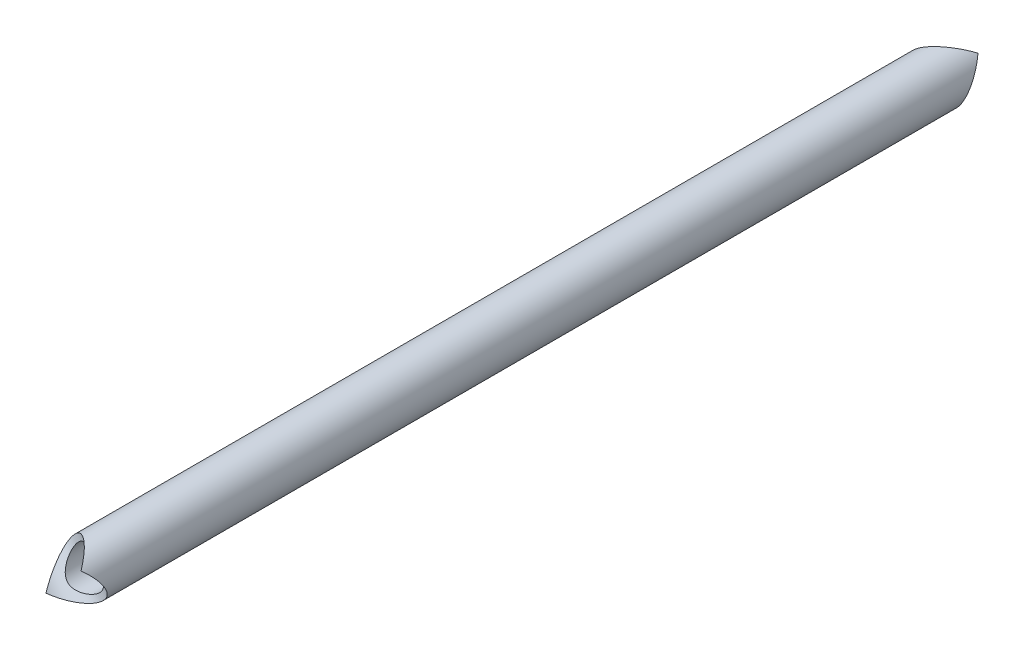
ISO-10303-21;
HEADER;
FILE_DESCRIPTION(('STEP AP214'),'2;1');
FILE_NAME('part.step','',(''),(''),'','','');
FILE_SCHEMA(('AUTOMOTIVE_DESIGN { 1 0 10303 214 1 1 1 1 }'));
ENDSEC;
DATA;
#1=APPLICATION_CONTEXT('core data for automotive mechanical design processes');
#2=APPLICATION_PROTOCOL_DEFINITION('international standard','automotive_design',2000,#1);
#3=PRODUCT_CONTEXT('',#1,'mechanical');
#4=PRODUCT('Part','Part','',(#3));
#5=PRODUCT_RELATED_PRODUCT_CATEGORY('part','',(#4));
#6=PRODUCT_DEFINITION_FORMATION('','',#4);
#7=PRODUCT_DEFINITION_CONTEXT('part definition',#1,'design');
#8=PRODUCT_DEFINITION('design','',#6,#7);
#9=PRODUCT_DEFINITION_SHAPE('','',#8);
#10=(LENGTH_UNIT() NAMED_UNIT(*) SI_UNIT(.MILLI.,.METRE.));
#11=(NAMED_UNIT(*) PLANE_ANGLE_UNIT() SI_UNIT($,.RADIAN.));
#12=(NAMED_UNIT(*) SI_UNIT($,.STERADIAN.) SOLID_ANGLE_UNIT());
#13=UNCERTAINTY_MEASURE_WITH_UNIT(LENGTH_MEASURE(1.E-05),#10,'distance_accuracy_value','');
#14=(GEOMETRIC_REPRESENTATION_CONTEXT(3) GLOBAL_UNCERTAINTY_ASSIGNED_CONTEXT((#13)) GLOBAL_UNIT_ASSIGNED_CONTEXT((#10,
#11,#12)) REPRESENTATION_CONTEXT('',''));
#15=CARTESIAN_POINT('',(0.,0.,0.));
#16=DIRECTION('',(0.,0.,1.));
#17=DIRECTION('',(1.,0.,0.));
#18=AXIS2_PLACEMENT_3D('',#15,#16,#17);
#19=CARTESIAN_POINT('',(2364.73313789473,514.219766290026,-224.530173537895));
#20=DIRECTION('',(0.,0.,1.));
#21=DIRECTION('',(1.,0.,0.));
#22=AXIS2_PLACEMENT_3D('',#19,#20,#21);
#23=CYLINDRICAL_SURFACE('',#22,9.64999999999982);
#24=CARTESIAN_POINT('',(2374.38313789473,514.219766290025,214.670255781294));
#25=CARTESIAN_POINT('',(2374.38313808255,514.48201971603,214.760425362817));
#26=CARTESIAN_POINT('',(2374.37245226315,514.74390513474,214.851658796265));
#27=CARTESIAN_POINT('',(2374.32981875689,515.266132938578,215.03391829087));
#28=CARTESIAN_POINT('',(2374.29786246496,515.526474656171,215.124944253132));
#29=CARTESIAN_POINT('',(2374.21258641161,516.045065522865,215.304195289557));
#30=CARTESIAN_POINT('',(2374.15923500596,516.303310991743,215.392416005119));
#31=CARTESIAN_POINT('',(2374.03098030421,516.816402016813,215.562765211823));
#32=CARTESIAN_POINT('',(2373.95608393449,517.071248638173,215.644895650239));
#33=CARTESIAN_POINT('',(2373.80328011211,517.521035627229,215.782429872911));
#34=CARTESIAN_POINT('',(2373.72964225494,517.716846645342,215.839743057099));
#35=CARTESIAN_POINT('',(2373.56891839295,518.105071506958,215.946408625565));
#36=CARTESIAN_POINT('',(2373.48183595112,518.297486235511,215.995763111938));
#37=CARTESIAN_POINT('',(2373.29437103687,518.677635494648,216.084243225108));
#38=CARTESIAN_POINT('',(2373.19401817692,518.865379371022,216.123391065975));
#39=CARTESIAN_POINT('',(2372.98004275199,519.235411706149,216.189342593095));
#40=CARTESIAN_POINT('',(2372.86642297691,519.417701301788,216.216148868807));
#41=CARTESIAN_POINT('',(2372.64549588637,519.746965326182,216.252226608424));
#42=CARTESIAN_POINT('',(2372.54004524568,519.894955553623,216.263604761974));
#43=CARTESIAN_POINT('',(2372.32071746326,520.185013980812,216.275157779931));
#44=CARTESIAN_POINT('',(2372.20684131261,520.327082874021,216.275333959931));
#45=CARTESIAN_POINT('',(2371.97153923492,520.60420593151,216.263871779228));
#46=CARTESIAN_POINT('',(2371.85011727051,520.739263710368,216.252239571216));
#47=CARTESIAN_POINT('',(2371.60068369811,521.001511500123,216.217043685097));
#48=CARTESIAN_POINT('',(2371.47267188028,521.128701260198,216.193479626839));
#49=CARTESIAN_POINT('',(2371.21158563812,521.374079855179,216.134887878899));
#50=CARTESIAN_POINT('',(2371.07852882691,521.492296332405,216.099897315335));
#51=CARTESIAN_POINT('',(2370.80801113251,521.719745783443,216.019240372173));
#52=CARTESIAN_POINT('',(2370.67054842432,521.828974965948,215.973569517974));
#53=CARTESIAN_POINT('',(2370.25273850926,522.143012543982,215.822033555208));
#54=CARTESIAN_POINT('',(2369.96711599436,522.334034674315,215.701679616841));
#55=CARTESIAN_POINT('',(2369.45114760468,522.641918524382,215.462102167777));
#56=CARTESIAN_POINT('',(2369.22232100826,522.765869648958,215.348348707594));
#57=CARTESIAN_POINT('',(2368.7608468601,522.992801167675,215.108037213251));
#58=CARTESIAN_POINT('',(2368.52819721108,523.095769605731,214.981471939958));
#59=CARTESIAN_POINT('',(2368.05948327602,523.281867544555,214.719238147483));
#60=CARTESIAN_POINT('',(2367.82341280292,523.364954577009,214.583550920654));
#61=CARTESIAN_POINT('',(2367.34865900657,523.511874219911,214.30660201296));
#62=CARTESIAN_POINT('',(2367.10997610416,523.575709885626,214.165341220669));
#63=CARTESIAN_POINT('',(2366.61807465916,523.687409652716,213.87283339981));
#64=CARTESIAN_POINT('',(2366.36472603522,523.73431560252,213.721440208481));
#65=CARTESIAN_POINT('',(2365.85530579232,523.807751565453,213.418254098226));
#66=CARTESIAN_POINT('',(2365.59923395139,523.834279904482,213.266461147485));
#67=CARTESIAN_POINT('',(2365.08477989803,523.866797631237,212.96511398704));
#68=CARTESIAN_POINT('',(2364.82639997138,523.872805475295,212.815557886115));
#69=CARTESIAN_POINT('',(2364.30745144093,523.863864043597,212.520937501229));
#70=CARTESIAN_POINT('',(2364.0468830773,523.848917038386,212.375872732356));
#71=CARTESIAN_POINT('',(2363.54743321558,523.799632101498,212.105249445946));
#72=CARTESIAN_POINT('',(2363.30868830028,523.767140812126,211.979104634793));
#73=CARTESIAN_POINT('',(2362.83053432901,523.683460051141,211.734404257281));
#74=CARTESIAN_POINT('',(2362.59112525828,523.632270160567,211.615848861042));
#75=CARTESIAN_POINT('',(2362.11286449719,523.510487590107,211.388436715519));
#76=CARTESIAN_POINT('',(2361.87401250268,523.439911889878,211.279571588694));
#77=CARTESIAN_POINT('',(2361.39805278381,523.27861837228,211.073558271176));
#78=CARTESIAN_POINT('',(2361.16094467039,523.187905197536,210.976407387757));
#79=CARTESIAN_POINT('',(2360.73647309743,523.005638492636,210.813725584907));
#80=CARTESIAN_POINT('',(2360.548479185,522.917743563572,210.74573091353));
#81=CARTESIAN_POINT('',(2360.17593362559,522.728468872491,210.619876570796));
#82=CARTESIAN_POINT('',(2359.99138124375,522.627092027726,210.562014713132));
#83=CARTESIAN_POINT('',(2359.62710399681,522.410965225827,210.457538598417));
#84=CARTESIAN_POINT('',(2359.44737650749,522.296222727224,210.410918112438));
#85=CARTESIAN_POINT('',(2359.09409119265,522.053638831572,210.32986080176));
#86=CARTESIAN_POINT('',(2358.92053342094,521.925797320306,210.29542408331));
#87=CARTESIAN_POINT('',(2358.58017497507,521.656892074673,210.239367403501));
#88=CARTESIAN_POINT('',(2358.41341715959,521.515758880146,210.217819652277));
#89=CARTESIAN_POINT('',(2358.08922763093,521.221825012009,210.188370362252));
#90=CARTESIAN_POINT('',(2357.93179591887,521.069024336977,210.180468825117));
#91=CARTESIAN_POINT('',(2357.6276949412,520.753009239834,210.178512127246));
#92=CARTESIAN_POINT('',(2357.48102469763,520.589795766519,210.184455706717));
#93=CARTESIAN_POINT('',(2357.19963849445,520.25439965138,210.21003656234));
#94=CARTESIAN_POINT('',(2357.06492203838,520.082217382528,210.229673269478));
#95=CARTESIAN_POINT('',(2356.81930743665,519.745474582111,210.279910432109));
#96=CARTESIAN_POINT('',(2356.70735780792,519.581516476386,210.309432968344));
#97=CARTESIAN_POINT('',(2356.494646227,519.248562975747,210.378957927159));
#98=CARTESIAN_POINT('',(2356.39388848574,519.079565714988,210.418964275374));
#99=CARTESIAN_POINT('',(2356.2038723123,518.737770551765,210.508721826642));
#100=CARTESIAN_POINT('',(2356.11461314256,518.564972893905,210.558472404153));
#101=CARTESIAN_POINT('',(2355.94763466201,518.216610387768,210.666898006111));
#102=CARTESIAN_POINT('',(2355.86991766564,518.041044992289,210.725574815693));
#103=CARTESIAN_POINT('',(2355.70105333054,517.62706956538,210.872662516414));
#104=CARTESIAN_POINT('',(2355.61455029353,517.38791472572,210.964340282697));
#105=CARTESIAN_POINT('',(2355.46177857228,516.908225419553,211.160099620706));
#106=CARTESIAN_POINT('',(2355.39551572714,516.667690575278,211.264184759826));
#107=CARTESIAN_POINT('',(2355.28239967269,516.186308458115,211.482820693324));
#108=CARTESIAN_POINT('',(2355.23558143319,515.945461397076,211.597389895056));
#109=CARTESIAN_POINT('',(2355.16072624176,515.464982846506,211.834804890819));
#110=CARTESIAN_POINT('',(2355.13268970129,515.22535138372,211.957650866116));
#111=CARTESIAN_POINT('',(2355.0889441113,514.676674800974,212.247418530725));
#112=CARTESIAN_POINT('',(2355.07942417428,514.368289906157,212.416539639557));
#113=CARTESIAN_POINT('',(2355.08942963626,513.755798538593,212.761634429635));
#114=CARTESIAN_POINT('',(2355.10896592121,513.451693712471,212.937610655099));
#115=CARTESIAN_POINT('',(2355.17628734733,512.848125071221,213.292632586706));
#116=CARTESIAN_POINT('',(2355.22409599772,512.548665331517,213.471680726781));
#117=CARTESIAN_POINT('',(2355.34777296357,511.954956855995,213.828567383006));
#118=CARTESIAN_POINT('',(2355.4236323176,511.660706487353,214.006406267022));
#119=CARTESIAN_POINT('',(2355.58291892675,511.145562921765,214.315427692397));
#120=CARTESIAN_POINT('',(2355.6604568431,510.923563491889,214.44781997414));
#121=CARTESIAN_POINT('',(2355.83292484589,510.48282770922,214.706694388622));
#122=CARTESIAN_POINT('',(2355.92785549193,510.264091461664,214.833176331032));
#123=CARTESIAN_POINT('',(2356.13564175984,509.830784177825,215.076991446349));
#124=CARTESIAN_POINT('',(2356.2484556142,509.616204712152,215.194345010013));
#125=CARTESIAN_POINT('',(2356.4930502874,509.191501860313,215.416722305924));
#126=CARTESIAN_POINT('',(2356.62482331457,508.981376684069,215.521751071262));
#127=CARTESIAN_POINT('',(2356.86760597176,508.626195168841,215.687829083658));
#128=CARTESIAN_POINT('',(2356.97379072109,508.479701109726,215.752870042953));
#129=CARTESIAN_POINT('',(2357.19633313074,508.190475671762,215.873119278664));
#130=CARTESIAN_POINT('',(2357.31268762065,508.047743138192,215.928330603274));
#131=CARTESIAN_POINT('',(2357.55531297331,507.767195927053,216.027426471761));
#132=CARTESIAN_POINT('',(2357.68156921727,507.6293744207,216.071327318395));
#133=CARTESIAN_POINT('',(2357.94372826446,507.359607260369,216.146724028708));
#134=CARTESIAN_POINT('',(2358.07963094943,507.227661534397,216.178220044413));
#135=CARTESIAN_POINT('',(2358.36105065391,506.970245541346,216.228200743074));
#136=CARTESIAN_POINT('',(2358.50661396888,506.844812491252,216.246616954905));
#137=CARTESIAN_POINT('',(2358.80563582888,506.602400315216,216.27002966125));
#138=CARTESIAN_POINT('',(2358.9590942754,506.485421083835,216.275026323164));
#139=CARTESIAN_POINT('',(2359.27283617522,506.26081723206,216.272098525308));
#140=CARTESIAN_POINT('',(2359.43312714505,506.153203332091,216.264159457828));
#141=CARTESIAN_POINT('',(2359.75911823965,505.94820514366,216.236380977142));
#142=CARTESIAN_POINT('',(2359.92481911374,505.850822280232,216.216539908739));
#143=CARTESIAN_POINT('',(2360.29483095667,505.647888532291,216.161224279869));
#144=CARTESIAN_POINT('',(2360.50010635429,505.544741690832,216.123381994854));
#145=CARTESIAN_POINT('',(2360.91521708808,505.354204629792,216.035224651879));
#146=CARTESIAN_POINT('',(2361.12505347454,505.266818083441,215.984906692706));
#147=CARTESIAN_POINT('',(2361.54846463321,505.10759774409,215.874445638037));
#148=CARTESIAN_POINT('',(2361.76204585167,505.035794362801,215.814283725404));
#149=CARTESIAN_POINT('',(2362.19166810293,504.907747786383,215.686739742833));
#150=CARTESIAN_POINT('',(2362.40770927128,504.85150545314,215.619357273255));
#151=CARTESIAN_POINT('',(2362.90364314756,504.740463583915,215.459642508764));
#152=CARTESIAN_POINT('',(2363.18413953652,504.690669515995,215.365683121378));
#153=CARTESIAN_POINT('',(2363.74705987952,504.616079999536,215.173633321692));
#154=CARTESIAN_POINT('',(2364.02948428533,504.591290627621,215.075541911261));
#155=CARTESIAN_POINT('',(2364.59525269075,504.566597509493,214.878684738431));
#156=CARTESIAN_POINT('',(2364.87859686656,504.566698851929,214.779918842269));
#157=CARTESIAN_POINT('',(2365.44497827439,504.591883600489,214.584767446744));
#158=CARTESIAN_POINT('',(2365.72801553078,504.616964851931,214.488381742808));
#159=CARTESIAN_POINT('',(2366.29377604089,504.69250393374,214.300252892088));
#160=CARTESIAN_POINT('',(2366.57649151412,504.743080921871,214.208533792038));
#161=CARTESIAN_POINT('',(2367.13856856193,504.869932275001,214.032760431236));
#162=CARTESIAN_POINT('',(2367.41793001813,504.946207544111,213.948706440289));
#163=CARTESIAN_POINT('',(2367.97094529835,505.124524994486,213.790700051386));
#164=CARTESIAN_POINT('',(2368.24460451495,505.226541512046,213.716737704682));
#165=CARTESIAN_POINT('',(2368.78404524283,505.456288108977,213.580982609766));
#166=CARTESIAN_POINT('',(2369.04982792917,505.584014330413,213.519188038435));
#167=CARTESIAN_POINT('',(2369.54637031749,505.851539851425,213.414795818491));
#168=CARTESIAN_POINT('',(2369.77807906088,505.989088645695,213.3709424081));
#169=CARTESIAN_POINT('',(2370.23058611336,506.284181964992,213.2959609031));
#170=CARTESIAN_POINT('',(2370.45138504309,506.44172535074,213.264832083878));
#171=CARTESIAN_POINT('',(2370.87966674849,506.775550809529,213.216192305887));
#172=CARTESIAN_POINT('',(2371.08715976277,506.951818190538,213.198670758415));
#173=CARTESIAN_POINT('',(2371.4868574665,507.321659386359,213.177715484194));
#174=CARTESIAN_POINT('',(2371.67906389062,507.515231232227,213.174280156759));
#175=CARTESIAN_POINT('',(2372.02221571804,507.891422606561,213.181108539665));
#176=CARTESIAN_POINT('',(2372.17526892982,508.072159684562,213.189638137785));
#177=CARTESIAN_POINT('',(2372.46732571385,508.443894123112,213.217212373858));
#178=CARTESIAN_POINT('',(2372.60632941587,508.634891388876,213.23625691469));
#179=CARTESIAN_POINT('',(2372.86945216446,509.025692989288,213.284453338978));
#180=CARTESIAN_POINT('',(2372.99356872683,509.225498786209,213.313606906156));
#181=CARTESIAN_POINT('',(2373.2262805505,509.632396387518,213.381408263322));
#182=CARTESIAN_POINT('',(2373.33487545982,509.839488356999,213.420056268557));
#183=CARTESIAN_POINT('',(2373.53606550226,510.259323015838,213.506030786875));
#184=CARTESIAN_POINT('',(2373.62867383039,510.472060876221,213.553350075693));
#185=CARTESIAN_POINT('',(2373.79781258301,510.902003966678,213.65578138832));
#186=CARTESIAN_POINT('',(2373.87434194327,511.11920949141,213.710893927538));
#187=CARTESIAN_POINT('',(2374.01122578373,511.55667107017,213.827853070974));
#188=CARTESIAN_POINT('',(2374.07159252778,511.776924677152,213.889694519047));
#189=CARTESIAN_POINT('',(2374.1762914779,512.21950169091,214.019040517443));
#190=CARTESIAN_POINT('',(2374.22062658574,512.441824715638,214.086544040195));
#191=CARTESIAN_POINT('',(2374.29921570531,512.923151551679,214.237185020368));
#192=CARTESIAN_POINT('',(2374.33074072643,513.182359651215,214.321100445317));
#193=CARTESIAN_POINT('',(2374.37270212978,513.701087048397,214.493082768008));
#194=CARTESIAN_POINT('',(2374.38313770911,513.960606357515,214.581149823679));
#195=CARTESIAN_POINT('',(2374.38313789473,514.219766290025,214.670255781294));
#196=B_SPLINE_CURVE_WITH_KNOTS('',3,(#24,#25,#26,#27,#28,#29,#30,#31,#32,#33,#34,#35,#36,#37,
#38,#39,#40,#41,#42,#43,#44,#45,#46,#47,#48,#49,#50,#51,#52,#53,#54,#55,#56,#57,#58,#59,#60,#61,
#62,#63,#64,#65,#66,#67,#68,#69,#70,#71,#72,#73,#74,#75,#76,#77,#78,#79,#80,#81,#82,#83,#84,#85,
#86,#87,#88,#89,#90,#91,#92,#93,#94,#95,#96,#97,#98,#99,#100,#101,#102,#103,#104,#105,#106,#107,
#108,#109,#110,#111,#112,#113,#114,#115,#116,#117,#118,#119,#120,#121,#122,#123,#124,#125,#126,
#127,#128,#129,#130,#131,#132,#133,#134,#135,#136,#137,#138,#139,#140,#141,#142,#143,#144,#145,
#146,#147,#148,#149,#150,#151,#152,#153,#154,#155,#156,#157,#158,#159,#160,#161,#162,#163,#164,
#165,#166,#167,#168,#169,#170,#171,#172,#173,#174,#175,#176,#177,#178,#179,#180,#181,#182,#183,
#184,#185,#186,#187,#188,#189,#190,#191,#192,#193,#194,#195),.UNSPECIFIED.,.T.,.F.,(4,2,2,2,2,2,
2,2,2,2,2,2,2,2,2,2,2,2,2,2,2,2,2,2,2,2,2,2,2,2,2,2,2,2,2,2,2,2,2,2,2,2,2,2,2,2,2,2,2,2,2,2,2,2,
2,2,2,2,2,2,2,2,2,2,2,2,2,2,2,2,2,2,2,2,2,2,2,2,2,2,2,2,2,2,2,4),(0.,0.831761280052768,
1.66385925787008,2.49719250832365,3.33025815396322,3.9804627112926,4.63049525073005,
5.27910100023827,5.92757059973964,6.47319633261907,7.01875798546877,7.5640355224907,
8.10933043323529,8.6528709541894,9.19663960545785,10.2847794545238,11.1357730011244,
11.9872501023101,12.8405301085215,13.6936746244359,14.5894757627196,15.4853504866729,
16.3804192397464,17.2753910159167,18.0906106894699,18.9058486299773,19.7203747837953,
20.534713346094,21.1892391171388,21.8436234898697,22.4976444256779,23.1516710647698,
23.8093283641287,24.4669857437052,25.1245832841365,25.7821534999249,26.3836406449066,
26.985353337724,27.5870274154919,28.1888219790781,28.9986469216497,29.8087052708786,
30.6202142127726,31.4317409329537,32.48582202543,33.5402981298181,34.595652294808,
35.6506695941895,36.4596789037737,37.2687142476383,38.0758871407183,38.8827292520713,
39.4590406361754,40.0351729921689,40.6104702137641,41.1857603845492,41.7640403624498,
42.342313126656,42.9212393597495,43.5002461221595,44.1976931848508,44.8953025910443,
45.5942614296343,46.2932589739373,47.1920123401149,48.0909840681271,48.990139581771,
49.8892175440759,50.7925369757319,51.6958881911005,52.5983423107377,53.5006611110653,
54.3184862440782,55.13626479885,55.9534063476211,56.7704550381256,57.4805666180139,
58.1906716390724,58.9008949895165,59.6111344428115,60.3207848460185,61.030482204221,
61.7396395238841,62.4486684205541,63.2705871055722,64.092537081544),.UNSPECIFIED.);
#197=CARTESIAN_POINT('',(2374.38313789473,514.219766290025,214.670255781294));
#198=VERTEX_POINT('',#197);
#199=EDGE_CURVE('E93',#198,#198,#196,.T.);
#200=ORIENTED_EDGE('',*,*,#199,.T.);
#201=EDGE_LOOP('',(#200));
#202=FACE_BOUND('',#201,.T.);
#203=CARTESIAN_POINT('',(2374.38313789472,514.219766290026,-214.670255781295));
#204=CARTESIAN_POINT('',(2374.38313762026,513.962217646412,-214.581705070565));
#205=CARTESIAN_POINT('',(2374.37282999265,513.704292595588,-214.494171066323));
#206=CARTESIAN_POINT('',(2374.33138487933,513.188727825646,-214.323186743601));
#207=CARTESIAN_POINT('',(2374.30024526863,512.931088138323,-214.239736842658));
#208=CARTESIAN_POINT('',(2374.21685983832,512.417182182849,-214.078766150041));
#209=CARTESIAN_POINT('',(2374.16460181781,512.160916795554,-214.00124881668));
#210=CARTESIAN_POINT('',(2374.03877639277,511.651414377186,-213.853976917283));
#211=CARTESIAN_POINT('',(2373.96521164504,511.398176972642,-213.784221384905));
#212=CARTESIAN_POINT('',(2373.79614530229,510.894811199666,-213.653689990975));
#213=CARTESIAN_POINT('',(2373.70050615947,510.644713151657,-213.592974534192));
#214=CARTESIAN_POINT('',(2373.48769271276,510.151296533314,-213.482584322771));
#215=CARTESIAN_POINT('',(2373.37051799373,509.907978093778,-213.432909781011));
#216=CARTESIAN_POINT('',(2373.11520441509,509.430541529666,-213.345956491893));
#217=CARTESIAN_POINT('',(2372.97708387569,509.196415588012,-213.308667002038));
#218=CARTESIAN_POINT('',(2372.68065398476,508.73947210038,-213.247466394648));
#219=CARTESIAN_POINT('',(2372.52234713493,508.516653157896,-213.223553621306));
#220=CARTESIAN_POINT('',(2372.20404646772,508.106806148924,-213.191521791636));
#221=CARTESIAN_POINT('',(2372.04589348642,507.91845187672,-213.182033611495));
#222=CARTESIAN_POINT('',(2371.71554075849,507.554259784722,-213.174599310804));
#223=CARTESIAN_POINT('',(2371.54334204601,507.378421045233,-213.176652341267));
#224=CARTESIAN_POINT('',(2371.18631723382,507.040674366597,-213.192250037943));
#225=CARTESIAN_POINT('',(2371.00149259984,506.87876481535,-213.205793372343));
#226=CARTESIAN_POINT('',(2370.62075009616,506.570021666961,-213.244049547772));
#227=CARTESIAN_POINT('',(2370.42483231211,506.423187953469,-213.268762302591));
#228=CARTESIAN_POINT('',(2370.03446014536,506.153061263319,-213.327151662112));
#229=CARTESIAN_POINT('',(2369.84050544595,506.028922394664,-213.360267792353));
#230=CARTESIAN_POINT('',(2369.44543727923,505.795432145992,-213.435331553858));
#231=CARTESIAN_POINT('',(2369.24432098636,505.686086686155,-213.477282703743));
#232=CARTESIAN_POINT('',(2368.8363869327,505.482616177422,-213.569197554258));
#233=CARTESIAN_POINT('',(2368.62957063963,505.388487252437,-213.619159207903));
#234=CARTESIAN_POINT('',(2368.21140533993,505.21558073854,-213.726197868016));
#235=CARTESIAN_POINT('',(2368.00005586447,505.136804746045,-213.783275613414));
#236=CARTESIAN_POINT('',(2367.55694849576,504.988980355912,-213.908351991979));
#237=CARTESIAN_POINT('',(2367.32490783975,504.921209780419,-213.976858631426));
#238=CARTESIAN_POINT('',(2366.85810221928,504.803558098165,-214.119665567095));
#239=CARTESIAN_POINT('',(2366.62333713015,504.75367781342,-214.193966129342));
#240=CARTESIAN_POINT('',(2366.15191519791,504.671631818347,-214.347006314784));
#241=CARTESIAN_POINT('',(2365.91525672993,504.639483471816,-214.4257502062));
#242=CARTESIAN_POINT('',(2365.44116374588,504.592827730155,-214.586084929231));
#243=CARTESIAN_POINT('',(2365.2037291704,504.578321719082,-214.667675983692));
#244=CARTESIAN_POINT('',(2364.69407733756,504.566004426387,-214.844093433815));
#245=CARTESIAN_POINT('',(2364.42185561271,504.570947431134,-214.939109116306));
#246=CARTESIAN_POINT('',(2363.87833595613,504.603844102184,-215.127978015811));
#247=CARTESIAN_POINT('',(2363.60703823625,504.631802729663,-215.221830977765));
#248=CARTESIAN_POINT('',(2363.06643282289,504.710865140636,-215.40515402914));
#249=CARTESIAN_POINT('',(2362.7971244418,504.761960506094,-215.494625699535));
#250=CARTESIAN_POINT('',(2362.26146283816,504.887620449772,-215.665487598949));
#251=CARTESIAN_POINT('',(2361.99510851918,504.962175996739,-215.746880921982));
#252=CARTESIAN_POINT('',(2361.54166153971,505.110615380584,-215.875873094409));
#253=CARTESIAN_POINT('',(2361.35352028048,505.178688998008,-215.926508399832));
#254=CARTESIAN_POINT('',(2360.98012459096,505.327199886525,-216.019555211017));
#255=CARTESIAN_POINT('',(2360.79486935331,505.407633628898,-216.061969056151));
#256=CARTESIAN_POINT('',(2360.42843537302,505.580726262304,-216.136587372012));
#257=CARTESIAN_POINT('',(2360.24724988306,505.673362851281,-216.168810111267));
#258=CARTESIAN_POINT('',(2359.88976820698,505.870757606587,-216.22123914398));
#259=CARTESIAN_POINT('',(2359.71347195389,505.975515606766,-216.241445602122));
#260=CARTESIAN_POINT('',(2359.36533660925,506.197778039186,-216.268298271844));
#261=CARTESIAN_POINT('',(2359.19356444985,506.315405655682,-216.274798683452));
#262=CARTESIAN_POINT('',(2358.85805210358,506.561493646984,-216.272583288594));
#263=CARTESIAN_POINT('',(2358.69431154229,506.689953516036,-216.263868192161));
#264=CARTESIAN_POINT('',(2358.37640599603,506.956332779221,-216.230777450841));
#265=CARTESIAN_POINT('',(2358.2222404384,507.094251606584,-216.206402743528));
#266=CARTESIAN_POINT('',(2357.92472263816,507.377965237866,-216.142419132459));
#267=CARTESIAN_POINT('',(2357.78137031895,507.523759985989,-216.102810336614));
#268=CARTESIAN_POINT('',(2357.5246177466,507.801773401673,-216.015774300986));
#269=CARTESIAN_POINT('',(2357.40977142662,507.933213195948,-215.970091577013));
#270=CARTESIAN_POINT('',(2357.18899660719,508.199930265043,-215.869267918267));
#271=CARTESIAN_POINT('',(2357.08307123699,508.335208864366,-215.814123685043));
#272=CARTESIAN_POINT('',(2356.77864823792,508.745766271832,-215.636268387651));
#273=CARTESIAN_POINT('',(2356.59354463444,509.025721904646,-215.501149381799));
#274=CARTESIAN_POINT('',(2356.28243803253,509.552044013383,-215.229351631508));
#275=CARTESIAN_POINT('',(2356.1517514498,509.797341564656,-215.095785409537));
#276=CARTESIAN_POINT('',(2355.9139716091,510.292893760994,-214.816993190429));
#277=CARTESIAN_POINT('',(2355.80689311313,510.543151401598,-214.671759974971));
#278=CARTESIAN_POINT('',(2355.61508016364,511.048524038954,-214.373695470019));
#279=CARTESIAN_POINT('',(2355.53040242333,511.303649643947,-214.220846037835));
#280=CARTESIAN_POINT('',(2355.3829992314,511.817907630211,-213.911514296611));
#281=CARTESIAN_POINT('',(2355.3202695747,512.077039234019,-213.7550326896));
#282=CARTESIAN_POINT('',(2355.21415692622,512.610797563506,-213.434547159374));
#283=CARTESIAN_POINT('',(2355.17175174043,512.885602884321,-213.270516492038));
#284=CARTESIAN_POINT('',(2355.11071286395,513.43936392138,-212.944937927786));
#285=CARTESIAN_POINT('',(2355.09208242598,513.718320200252,-212.78339037358));
#286=CARTESIAN_POINT('',(2355.07924963614,514.27945814618,-212.466080592123));
#287=CARTESIAN_POINT('',(2355.08500529287,514.561633435115,-212.310308885546));
#288=CARTESIAN_POINT('',(2355.1218565709,515.128888858432,-212.007316241499));
#289=CARTESIAN_POINT('',(2355.15294464684,515.413968102895,-211.860092771887));
#290=CARTESIAN_POINT('',(2355.2315599813,515.92045373624,-211.609686037618));
#291=CARTESIAN_POINT('',(2355.27370835709,516.141526154045,-211.504125962705));
#292=CARTESIAN_POINT('',(2355.37444415578,516.583824475876,-211.30155613144));
#293=CARTESIAN_POINT('',(2355.43302758221,516.805050329562,-211.204544303963));
#294=CARTESIAN_POINT('',(2355.56716507265,517.24641362196,-211.020766966979));
#295=CARTESIAN_POINT('',(2355.64270507765,517.466551808819,-210.933993059444));
#296=CARTESIAN_POINT('',(2355.81124199127,517.904503985716,-210.772295989845));
#297=CARTESIAN_POINT('',(2355.90423617784,518.122318332575,-210.697370983262));
#298=CARTESIAN_POINT('',(2356.09212772318,518.520478170532,-210.571596480262));
#299=CARTESIAN_POINT('',(2356.18450305098,518.701405326176,-210.518815554613));
#300=CARTESIAN_POINT('',(2356.38180887287,519.059136928165,-210.423865249002));
#301=CARTESIAN_POINT('',(2356.48673695883,519.235942157511,-210.381693838505));
#302=CARTESIAN_POINT('',(2356.70883010971,519.584054658543,-210.308805354383));
#303=CARTESIAN_POINT('',(2356.82598992324,519.755364248687,-210.278083390897));
#304=CARTESIAN_POINT('',(2357.07204602649,520.091179696877,-210.228725041655));
#305=CARTESIAN_POINT('',(2357.20094243358,520.255685486854,-210.210088776782));
#306=CARTESIAN_POINT('',(2357.47007087347,520.576998768884,-210.185286526985));
#307=CARTESIAN_POINT('',(2357.61033583741,520.733781616127,-210.179158221099));
#308=CARTESIAN_POINT('',(2357.90080849206,521.037829044054,-210.179627867506));
#309=CARTESIAN_POINT('',(2358.05101619647,521.18509361162,-210.186225837337));
#310=CARTESIAN_POINT('',(2358.36015106772,521.469013932484,-210.211995290921));
#311=CARTESIAN_POINT('',(2358.51907928907,521.605668397942,-210.231168298355));
#312=CARTESIAN_POINT('',(2358.84429015418,521.867481776524,-210.281654711994));
#313=CARTESIAN_POINT('',(2359.01057277646,521.992640723257,-210.312968082702));
#314=CARTESIAN_POINT('',(2359.34193533242,522.225809564812,-210.385489128747));
#315=CARTESIAN_POINT('',(2359.50676744104,522.334321514299,-210.426221105657));
#316=CARTESIAN_POINT('',(2359.84081923505,522.539995233358,-210.517472324799));
#317=CARTESIAN_POINT('',(2360.0100405552,522.637152697596,-210.567995260339));
#318=CARTESIAN_POINT('',(2360.35175890908,522.819974038073,-210.677983458914));
#319=CARTESIAN_POINT('',(2360.52425625971,522.905636795828,-210.737449590967));
#320=CARTESIAN_POINT('',(2360.87158558583,523.065527082075,-210.864434853117));
#321=CARTESIAN_POINT('',(2361.04641804415,523.139752204526,-210.931955672325));
#322=CARTESIAN_POINT('',(2361.47276677664,523.306291032919,-211.104586772687));
#323=CARTESIAN_POINT('',(2361.72508013657,523.392751617428,-211.213417418863));
#324=CARTESIAN_POINT('',(2362.23089207762,523.54344429819,-211.443087066357));
#325=CARTESIAN_POINT('',(2362.48439106488,523.607668109905,-211.563930521638));
#326=CARTESIAN_POINT('',(2362.99150561664,523.714842909317,-211.815342379276));
#327=CARTESIAN_POINT('',(2363.24512079433,523.757762134659,-211.945924970039));
#328=CARTESIAN_POINT('',(2363.75108488192,523.823054457556,-212.214332760803));
#329=CARTESIAN_POINT('',(2364.00343390225,523.845429378925,-212.352157316754));
#330=CARTESIAN_POINT('',(2364.51158116302,523.870646762895,-212.635844778325));
#331=CARTESIAN_POINT('',(2364.76733936904,523.873065810471,-212.781816074769));
#332=CARTESIAN_POINT('',(2365.27651149514,523.857822528948,-213.076773261114));
#333=CARTESIAN_POINT('',(2365.52992525046,523.840158799197,-213.225759360568));
#334=CARTESIAN_POINT('',(2366.03421106558,523.785018967126,-213.524429056378));
#335=CARTESIAN_POINT('',(2366.28508279358,523.747540311596,-213.674112740156));
#336=CARTESIAN_POINT('',(2366.78413081808,523.652710584244,-213.971644225745));
#337=CARTESIAN_POINT('',(2367.03230738949,523.595361559344,-214.119492215034));
#338=CARTESIAN_POINT('',(2367.49868021345,523.467798244886,-214.394474042642));
#339=CARTESIAN_POINT('',(2367.71716689798,523.399697674339,-214.522095332815));
#340=CARTESIAN_POINT('',(2368.15181907002,523.2468473562,-214.771303515908));
#341=CARTESIAN_POINT('',(2368.36798437802,523.16209633076,-214.892889944781));
#342=CARTESIAN_POINT('',(2368.79725654218,522.975343923811,-215.127043595127));
#343=CARTESIAN_POINT('',(2369.01036786135,522.873371274148,-215.239625385965));
#344=CARTESIAN_POINT('',(2369.4332051046,522.65118794936,-215.452747375406));
#345=CARTESIAN_POINT('',(2369.64293108931,522.530977601233,-215.553287789852));
#346=CARTESIAN_POINT('',(2370.00208248668,522.306347038531,-215.713795068656));
#347=CARTESIAN_POINT('',(2370.15262145517,522.206313776556,-215.777418605892));
#348=CARTESIAN_POINT('',(2370.45029575732,521.995998312273,-215.894690883547));
#349=CARTESIAN_POINT('',(2370.5974330438,521.885722182267,-215.948345477976));
#350=CARTESIAN_POINT('',(2370.88716112271,521.655135620684,-216.044245693143));
#351=CARTESIAN_POINT('',(2371.0297583023,521.53484023266,-216.086508028683));
#352=CARTESIAN_POINT('',(2371.30943205006,521.284472271196,-216.158602962584));
#353=CARTESIAN_POINT('',(2371.44650869255,521.154399829489,-216.18843572838));
#354=CARTESIAN_POINT('',(2371.71447547112,520.884579918575,-216.235117601799));
#355=CARTESIAN_POINT('',(2371.8453336769,520.744790047302,-216.251905336655));
#356=CARTESIAN_POINT('',(2372.09891927205,520.457116033358,-216.272199720327));
#357=CARTESIAN_POINT('',(2372.22164671477,520.3092319438,-216.27570645628));
#358=CARTESIAN_POINT('',(2372.45808734306,520.006355856427,-216.269995330906));
#359=CARTESIAN_POINT('',(2372.5717880237,519.851354452083,-216.260760132381));
#360=CARTESIAN_POINT('',(2372.78925823768,519.535610322578,-216.230616195069));
#361=CARTESIAN_POINT('',(2372.89302527159,519.374866166377,-216.209704527352));
#362=CARTESIAN_POINT('',(2373.11177837626,519.012974696056,-216.151904255446));
#363=CARTESIAN_POINT('',(2373.22423495643,518.810697038575,-216.11251772029));
#364=CARTESIAN_POINT('',(2373.43336270363,518.400862238047,-216.021325233647));
#365=CARTESIAN_POINT('',(2373.53002942697,518.19330362773,-215.969515796119));
#366=CARTESIAN_POINT('',(2373.70768739179,517.77390348188,-215.856221925784));
#367=CARTESIAN_POINT('',(2373.78866043149,517.562057284203,-215.794726406931));
#368=CARTESIAN_POINT('',(2373.93496310397,517.13521077136,-215.664673874246));
#369=CARTESIAN_POINT('',(2374.00029406902,516.920210726471,-215.59611746252));
#370=CARTESIAN_POINT('',(2374.1121840475,516.500215983541,-215.458305670906));
#371=CARTESIAN_POINT('',(2374.15961042649,516.295362061492,-215.389320194346));
#372=CARTESIAN_POINT('',(2374.24089496931,515.883816119102,-215.24871604373));
#373=CARTESIAN_POINT('',(2374.27474939255,515.677123608047,-215.177096649667));
#374=CARTESIAN_POINT('',(2374.32891293033,515.262496308082,-215.032749573777));
#375=CARTESIAN_POINT('',(2374.34922999962,515.054562321294,-214.960022568545));
#376=CARTESIAN_POINT('',(2374.37634290092,514.637757067169,-214.814725532773));
#377=CARTESIAN_POINT('',(2374.38313811758,514.428885757612,-214.742155509526));
#378=CARTESIAN_POINT('',(2374.38313789472,514.219766290026,-214.670255781295));
#379=B_SPLINE_CURVE_WITH_KNOTS('',3,(#203,#204,#205,#206,#207,#208,#209,#210,#211,#212,#213,
#214,#215,#216,#217,#218,#219,#220,#221,#222,#223,#224,#225,#226,#227,#228,#229,#230,#231,#232,
#233,#234,#235,#236,#237,#238,#239,#240,#241,#242,#243,#244,#245,#246,#247,#248,#249,#250,#251,
#252,#253,#254,#255,#256,#257,#258,#259,#260,#261,#262,#263,#264,#265,#266,#267,#268,#269,#270,
#271,#272,#273,#274,#275,#276,#277,#278,#279,#280,#281,#282,#283,#284,#285,#286,#287,#288,#289,
#290,#291,#292,#293,#294,#295,#296,#297,#298,#299,#300,#301,#302,#303,#304,#305,#306,#307,#308,
#309,#310,#311,#312,#313,#314,#315,#316,#317,#318,#319,#320,#321,#322,#323,#324,#325,#326,#327,
#328,#329,#330,#331,#332,#333,#334,#335,#336,#337,#338,#339,#340,#341,#342,#343,#344,#345,#346,
#347,#348,#349,#350,#351,#352,#353,#354,#355,#356,#357,#358,#359,#360,#361,#362,#363,#364,#365,
#366,#367,#368,#369,#370,#371,#372,#373,#374,#375,#376,#377,#378),.UNSPECIFIED.,.T.,.F.,(4,2,2,
2,2,2,2,2,2,2,2,2,2,2,2,2,2,2,2,2,2,2,2,2,2,2,2,2,2,2,2,2,2,2,2,2,2,2,2,2,2,2,2,2,2,2,2,2,2,2,2,
2,2,2,2,2,2,2,2,2,2,2,2,2,2,2,2,2,2,2,2,2,2,2,2,2,2,2,2,2,2,2,2,2,2,2,2,4),(0.,
0.816876755718712,1.63383685059502,2.45126961057869,3.26860048623897,4.0911687109941,
4.91375279426744,5.7356215131235,6.55738847626187,7.29481101183151,8.03217930236928,
8.7694621381053,9.50673928332367,10.2039270857351,10.9013930758572,11.5986811203631,
12.2960416310873,13.0490487399936,13.8020904432822,14.5558682506974,15.3097051887918,
16.1738776207061,17.0382363796991,17.9022809040537,18.7659932111325,19.3846676610843,
20.0031658113156,20.620548876729,21.2379234806345,21.8618330294102,22.4857134641829,
23.1095565493489,23.7333952155665,24.2741266754806,24.8150470284784,25.8970732199002,
26.8210021740053,27.7455072279406,28.6723309736511,29.5989770498962,30.5665858054258,
31.5343269289766,32.5004023376832,33.4661901020189,34.2113158112999,34.9562604873943,
35.7005897832013,36.4448030949019,37.0738365194976,37.7027494627385,38.3313934993853,
38.9600438237305,39.5905851189632,40.221127283201,40.8517458625588,41.4823625980619,
42.0862469133309,42.6903594684642,43.2945307636793,43.8988289803837,44.7617426371714,
45.6249774362348,46.4894953690237,47.353936547101,48.2366730962686,49.1194712147364,
50.0023831119681,50.8852040841478,51.6707548699465,52.4563659668916,53.2406791015048,
54.0249781752017,54.5993316532618,55.1733467832183,55.7465150724957,56.3196756405222,
56.8955166914811,57.4713539643028,58.047975518076,58.6247417768915,59.3279829578973,
60.0314217097982,60.7356715010816,61.4398612884043,62.1033107928193,62.7669430256881,
63.4301849538737,64.093457063728),.UNSPECIFIED.);
#380=CARTESIAN_POINT('',(2374.38313789472,514.219766290026,-214.670255781295));
#381=VERTEX_POINT('',#380);
#382=EDGE_CURVE('E87',#381,#381,#379,.T.);
#383=ORIENTED_EDGE('',*,*,#382,.T.);
#384=EDGE_LOOP('',(#383));
#385=FACE_BOUND('',#384,.T.);
#386=ADVANCED_FACE('F46',(#202,#385),#23,.F.);
#387=CARTESIAN_POINT('',(2364.73313789473,514.219766290026,-224.530173537895));
#388=DIRECTION('',(0.,0.,1.));
#389=DIRECTION('',(1.,0.,0.));
#390=AXIS2_PLACEMENT_3D('',#387,#388,#389);
#391=CYLINDRICAL_SURFACE('',#390,12.6999999999999);
#392=CARTESIAN_POINT('',(2364.73313789473,514.219766290025,224.530173537894));
#393=DIRECTION('',(0.470964385158369,-0.448849971586308,0.75942494752238));
#394=DIRECTION('',(-0.549746228947771,0.5239325669178,0.650594919347385));
#395=AXIS2_PLACEMENT_3D('',#392,#393,#394);
#396=ELLIPSE('',#395,16.7231798763441,12.6999999999999);
#397=CARTESIAN_POINT('',(2355.97131933508,505.026261216989,224.530173537894));
#398=VERTEX_POINT('',#397);
#399=CARTESIAN_POINT('',(2373.49495645437,523.41327136306,224.530173537894));
#400=VERTEX_POINT('',#399);
#401=EDGE_CURVE('E76',#398,#400,#396,.T.);
#402=ORIENTED_EDGE('',*,*,#401,.F.);
#403=CARTESIAN_POINT('',(2364.73313789473,514.219766290025,224.530173537894));
#404=DIRECTION('',(-0.549746228947771,0.5239325669178,0.650594919347385));
#405=DIRECTION('',(0.470964385158369,-0.448849971586308,0.75942494752238));
#406=AXIS2_PLACEMENT_3D('',#403,#404,#405);
#407=ELLIPSE('',#406,19.5205951081502,12.6999999999999);
#408=EDGE_CURVE('E79',#400,#398,#407,.T.);
#409=ORIENTED_EDGE('',*,*,#408,.F.);
#410=EDGE_LOOP('',(#402,#409));
#411=FACE_BOUND('',#410,.T.);
#412=CARTESIAN_POINT('',(2364.73313789472,514.219766290025,-224.530173537895));
#413=DIRECTION('',(-0.470964385158368,0.448849971586308,0.759424947522381));
#414=DIRECTION('',(0.549746228947772,-0.5239325669178,0.650594919347384));
#415=AXIS2_PLACEMENT_3D('',#412,#413,#414);
#416=ELLIPSE('',#415,16.7231798763441,12.7);
#417=CARTESIAN_POINT('',(2373.49495645437,523.41327136306,-224.530173537895));
#418=VERTEX_POINT('',#417);
#419=CARTESIAN_POINT('',(2355.97131933508,505.02626121699,-224.530173537895));
#420=VERTEX_POINT('',#419);
#421=EDGE_CURVE('E57',#418,#420,#416,.F.);
#422=ORIENTED_EDGE('',*,*,#421,.F.);
#423=CARTESIAN_POINT('',(2364.73313789472,514.219766290025,-224.530173537895));
#424=DIRECTION('',(0.549746228947772,-0.5239325669178,0.650594919347384));
#425=DIRECTION('',(-0.470964385158368,0.448849971586308,0.759424947522381));
#426=AXIS2_PLACEMENT_3D('',#423,#424,#425);
#427=ELLIPSE('',#426,19.5205951081503,12.7);
#428=EDGE_CURVE('E11',#420,#418,#427,.F.);
#429=ORIENTED_EDGE('',*,*,#428,.F.);
#430=EDGE_LOOP('',(#422,#429));
#431=FACE_BOUND('',#430,.T.);
#432=ADVANCED_FACE('F84',(#411,#431),#391,.T.);
#433=CARTESIAN_POINT('',(1799.99999999996,1052.43552290753,103.38271055945));
#434=DIRECTION('',(0.715324206967608,-0.681735732234708,0.153452501838741));
#435=DIRECTION('',(0.689906973200086,0.723898037246887,0.));
#436=AXIS2_PLACEMENT_3D('',#433,#434,#435);
#437=CYLINDRICAL_SURFACE('',#436,12.7);
#438=ORIENTED_EDGE('',*,*,#199,.F.);
#439=EDGE_LOOP('',(#438));
#440=FACE_BOUND('',#439,.T.);
#441=ORIENTED_EDGE('',*,*,#401,.T.);
#442=ORIENTED_EDGE('',*,*,#408,.T.);
#443=EDGE_LOOP('',(#441,#442));
#444=FACE_BOUND('',#443,.T.);
#445=ADVANCED_FACE('F80',(#440,#444),#437,.F.);
#446=CARTESIAN_POINT('',(2599.99999999996,289.999999999996,-275.000000000001));
#447=DIRECTION('',(-0.715324206967608,0.681735732234708,0.153452501838741));
#448=DIRECTION('',(-0.689906973200086,-0.723898037246887,0.));
#449=AXIS2_PLACEMENT_3D('',#446,#447,#448);
#450=CYLINDRICAL_SURFACE('',#449,12.7000000000001);
#451=ORIENTED_EDGE('',*,*,#382,.F.);
#452=EDGE_LOOP('',(#451));
#453=FACE_BOUND('',#452,.T.);
#454=ORIENTED_EDGE('',*,*,#421,.T.);
#455=ORIENTED_EDGE('',*,*,#428,.T.);
#456=EDGE_LOOP('',(#454,#455));
#457=FACE_BOUND('',#456,.T.);
#458=ADVANCED_FACE('F48',(#453,#457),#450,.F.);
#459=CLOSED_SHELL('',(#386,#432,#445,#458));
#460=MANIFOLD_SOLID_BREP('B2',#459);
#461=ADVANCED_BREP_SHAPE_REPRESENTATION('',(#18,#460),#14);
#462=SHAPE_DEFINITION_REPRESENTATION(#9,#461);
ENDSEC;
END-ISO-10303-21;
